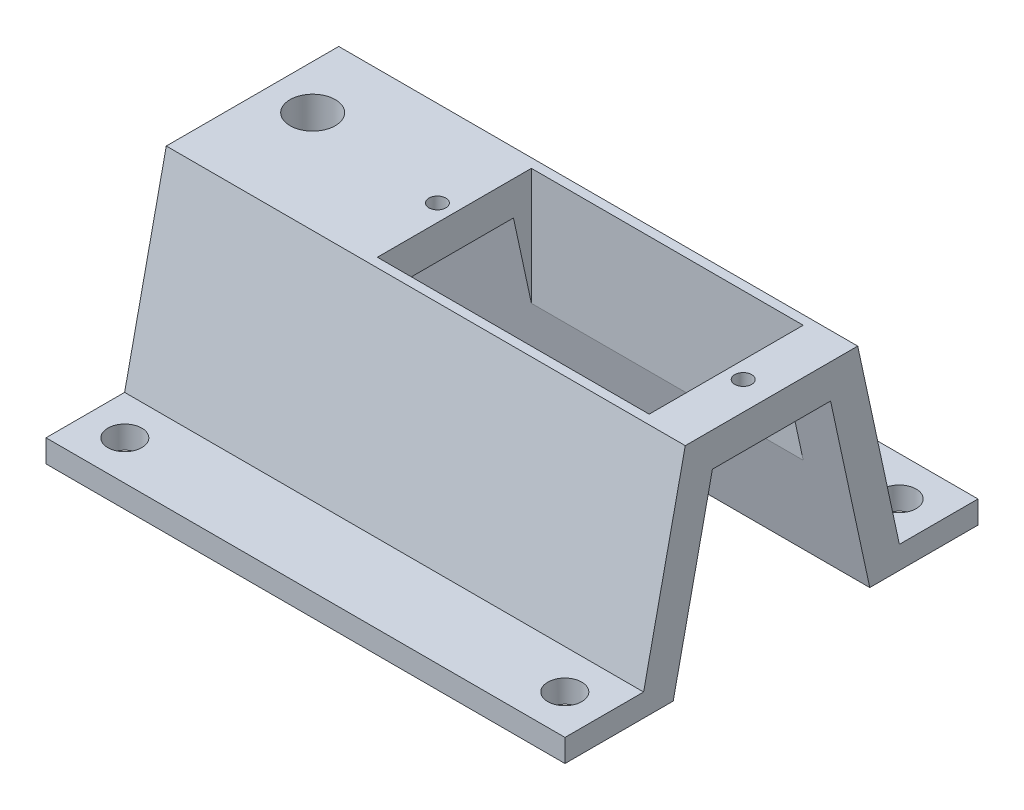
ISO-10303-21;
HEADER;
FILE_DESCRIPTION(('STEP AP214'),'2;1');
FILE_NAME('part.step','',(''),(''),'','','');
FILE_SCHEMA(('AUTOMOTIVE_DESIGN { 1 0 10303 214 1 1 1 1 }'));
ENDSEC;
DATA;
#1=APPLICATION_CONTEXT('core data for automotive mechanical design processes');
#2=APPLICATION_PROTOCOL_DEFINITION('international standard','automotive_design',2000,#1);
#3=PRODUCT_CONTEXT('',#1,'mechanical');
#4=PRODUCT('Part','Part','',(#3));
#5=PRODUCT_RELATED_PRODUCT_CATEGORY('part','',(#4));
#6=PRODUCT_DEFINITION_FORMATION('','',#4);
#7=PRODUCT_DEFINITION_CONTEXT('part definition',#1,'design');
#8=PRODUCT_DEFINITION('design','',#6,#7);
#9=PRODUCT_DEFINITION_SHAPE('','',#8);
#10=(LENGTH_UNIT() NAMED_UNIT(*) SI_UNIT(.MILLI.,.METRE.));
#11=(NAMED_UNIT(*) PLANE_ANGLE_UNIT() SI_UNIT($,.RADIAN.));
#12=(NAMED_UNIT(*) SI_UNIT($,.STERADIAN.) SOLID_ANGLE_UNIT());
#13=UNCERTAINTY_MEASURE_WITH_UNIT(LENGTH_MEASURE(1.E-05),#10,'distance_accuracy_value','');
#14=(GEOMETRIC_REPRESENTATION_CONTEXT(3) GLOBAL_UNCERTAINTY_ASSIGNED_CONTEXT((#13)) GLOBAL_UNIT_ASSIGNED_CONTEXT((#10,
#11,#12)) REPRESENTATION_CONTEXT('',''));
#15=CARTESIAN_POINT('',(0.,0.,0.));
#16=DIRECTION('',(0.,0.,1.));
#17=DIRECTION('',(1.,0.,0.));
#18=AXIS2_PLACEMENT_3D('',#15,#16,#17);
#19=CARTESIAN_POINT('',(16.,3.02819959593388,6.04711533635104));
#20=DIRECTION('',(0.,1.,0.));
#21=DIRECTION('',(0.,0.,1.));
#22=AXIS2_PLACEMENT_3D('',#19,#20,#21);
#23=PLANE('',#22);
#24=CARTESIAN_POINT('',(-25.9118097281455,3.02819959593388,-1.35212729891275));
#25=DIRECTION('',(0.,-1.,0.));
#26=DIRECTION('',(0.,0.,-1.));
#27=AXIS2_PLACEMENT_3D('',#24,#25,#26);
#28=CIRCLE('',#27,2.);
#29=CARTESIAN_POINT('',(-25.9118097281455,3.02819959593388,-3.35212729891275));
#30=VERTEX_POINT('',#29);
#31=EDGE_CURVE('E321',#30,#30,#28,.T.);
#32=ORIENTED_EDGE('',*,*,#31,.F.);
#33=EDGE_LOOP('',(#32));
#34=FACE_BOUND('',#33,.T.);
#35=CARTESIAN_POINT('',(-13.5,3.02819959593388,0.0471153363510377));
#36=DIRECTION('',(0.,1.,0.));
#37=DIRECTION('',(0.,0.,1.));
#38=AXIS2_PLACEMENT_3D('',#35,#36,#37);
#39=CIRCLE('',#38,0.75);
#40=CARTESIAN_POINT('',(-13.5,3.02819959593388,0.797115336351038));
#41=VERTEX_POINT('',#40);
#42=EDGE_CURVE('E240',#41,#41,#39,.T.);
#43=ORIENTED_EDGE('',*,*,#42,.T.);
#44=EDGE_LOOP('',(#43));
#45=FACE_BOUND('',#44,.T.);
#46=DIRECTION('',(0.,0.,-1.));
#47=VECTOR('',#46,1.);
#48=CARTESIAN_POINT('',(-12.,3.02819959593388,6.04711533635104));
#49=LINE('',#48,#47);
#50=CARTESIAN_POINT('',(-12.,3.02819959593388,5.26347606124684));
#51=VERTEX_POINT('',#50);
#52=CARTESIAN_POINT('',(-12.,3.02819959593389,-5.16924538854475));
#53=VERTEX_POINT('',#52);
#54=EDGE_CURVE('E344',#51,#53,#49,.T.);
#55=ORIENTED_EDGE('',*,*,#54,.F.);
#56=DIRECTION('',(-1.,0.,0.));
#57=VECTOR('',#56,1.);
#58=CARTESIAN_POINT('',(16.,3.02819959593388,5.26347606124684));
#59=LINE('',#58,#57);
#60=CARTESIAN_POINT('',(-29.8253336560652,3.02819959593388,5.26347606124684));
#61=VERTEX_POINT('',#60);
#62=EDGE_CURVE('E273',#51,#61,#59,.T.);
#63=ORIENTED_EDGE('',*,*,#62,.T.);
#64=DIRECTION('',(0.,0.,-1.));
#65=VECTOR('',#64,1.);
#66=CARTESIAN_POINT('',(-29.8253336560652,3.02819959593388,6.04711533635104));
#67=LINE('',#66,#65);
#68=CARTESIAN_POINT('',(-29.8253336560652,3.02819959593388,-5.16924538854476));
#69=VERTEX_POINT('',#68);
#70=EDGE_CURVE('E297',#61,#69,#67,.T.);
#71=ORIENTED_EDGE('',*,*,#70,.T.);
#72=DIRECTION('',(-1.,0.,0.));
#73=VECTOR('',#72,1.);
#74=CARTESIAN_POINT('',(16.,3.02819959593388,-5.16924538854476));
#75=LINE('',#74,#73);
#76=EDGE_CURVE('E277',#53,#69,#75,.T.);
#77=ORIENTED_EDGE('',*,*,#76,.F.);
#78=EDGE_LOOP('',(#55,#63,#71,#77));
#79=FACE_BOUND('',#78,.T.);
#80=ADVANCED_FACE('F83',(#34,#45,#79),#23,.F.);
#81=CARTESIAN_POINT('',(16.,-10.9717320567407,15.280676677086));
#82=DIRECTION('',(0.,1.,0.));
#83=DIRECTION('',(0.,0.,1.));
#84=AXIS2_PLACEMENT_3D('',#81,#82,#83);
#85=PLANE('',#84);
#86=CARTESIAN_POINT('',(12.5108355209188,-10.9717320567407,14.8096257080144));
#87=DIRECTION('',(0.,1.,0.));
#88=DIRECTION('',(0.,0.,-1.));
#89=AXIS2_PLACEMENT_3D('',#86,#87,#88);
#90=CIRCLE('',#89,1.5);
#91=CARTESIAN_POINT('',(12.5108355209188,-10.9717320567407,13.3096257080144));
#92=VERTEX_POINT('',#91);
#93=EDGE_CURVE('E439',#92,#92,#90,.T.);
#94=ORIENTED_EDGE('',*,*,#93,.F.);
#95=EDGE_LOOP('',(#94));
#96=FACE_BOUND('',#95,.T.);
#97=CARTESIAN_POINT('',(-26.3361691769839,-10.9717320567407,14.8096257080144));
#98=DIRECTION('',(0.,1.,0.));
#99=DIRECTION('',(0.,0.,1.));
#100=AXIS2_PLACEMENT_3D('',#97,#98,#99);
#101=CIRCLE('',#100,1.5);
#102=CARTESIAN_POINT('',(-26.3361691769839,-10.9717320567407,16.3096257080144));
#103=VERTEX_POINT('',#102);
#104=EDGE_CURVE('E436',#103,#103,#101,.T.);
#105=ORIENTED_EDGE('',*,*,#104,.F.);
#106=EDGE_LOOP('',(#105));
#107=FACE_BOUND('',#106,.T.);
#108=DIRECTION('',(0.,0.,-1.));
#109=VECTOR('',#108,1.);
#110=CARTESIAN_POINT('',(-29.8253336560652,-10.9717320567407,15.280676677086));
#111=LINE('',#110,#109);
#112=CARTESIAN_POINT('',(-29.8253336560652,-10.9717320567407,18.280676677086));
#113=VERTEX_POINT('',#112);
#114=CARTESIAN_POINT('',(-29.8253336560652,-10.9717320567407,11.3385747389429));
#115=VERTEX_POINT('',#114);
#116=EDGE_CURVE('E290',#113,#115,#111,.T.);
#117=ORIENTED_EDGE('',*,*,#116,.F.);
#118=DIRECTION('',(-1.,0.,0.));
#119=VECTOR('',#118,1.);
#120=CARTESIAN_POINT('',(16.,-10.9717320567407,18.280676677086));
#121=LINE('',#120,#119);
#122=CARTESIAN_POINT('',(16.,-10.9717320567407,18.280676677086));
#123=VERTEX_POINT('',#122);
#124=EDGE_CURVE('E12',#123,#113,#121,.T.);
#125=ORIENTED_EDGE('',*,*,#124,.F.);
#126=DIRECTION('',(0.,0.,-1.));
#127=VECTOR('',#126,1.);
#128=CARTESIAN_POINT('',(16.,-10.9717320567407,15.280676677086));
#129=LINE('',#128,#127);
#130=CARTESIAN_POINT('',(16.,-10.9717320567407,11.3385747389429));
#131=VERTEX_POINT('',#130);
#132=EDGE_CURVE('E228',#123,#131,#129,.T.);
#133=ORIENTED_EDGE('',*,*,#132,.T.);
#134=DIRECTION('',(-1.,0.,0.));
#135=VECTOR('',#134,1.);
#136=CARTESIAN_POINT('',(16.,-10.9717320567407,11.3385747389429));
#137=LINE('',#136,#135);
#138=EDGE_CURVE('E212',#131,#115,#137,.T.);
#139=ORIENTED_EDGE('',*,*,#138,.T.);
#140=EDGE_LOOP('',(#117,#125,#133,#139));
#141=FACE_BOUND('',#140,.T.);
#142=ADVANCED_FACE('F233',(#96,#107,#141),#85,.T.);
#143=CARTESIAN_POINT('',(16.,-10.9717320567407,18.280676677086));
#144=DIRECTION('',(0.,0.,-1.));
#145=DIRECTION('',(-1.,0.,0.));
#146=AXIS2_PLACEMENT_3D('',#143,#144,#145);
#147=PLANE('',#146);
#148=DIRECTION('',(0.,-1.,0.));
#149=VECTOR('',#148,1.);
#150=CARTESIAN_POINT('',(-29.8253336560652,-10.9717320567407,18.280676677086));
#151=LINE('',#150,#149);
#152=CARTESIAN_POINT('',(-29.8253336560652,-12.9717320567407,18.280676677086));
#153=VERTEX_POINT('',#152);
#154=EDGE_CURVE('E235',#113,#153,#151,.T.);
#155=ORIENTED_EDGE('',*,*,#154,.T.);
#156=DIRECTION('',(-1.,0.,0.));
#157=VECTOR('',#156,1.);
#158=CARTESIAN_POINT('',(16.,-12.9717320567407,18.280676677086));
#159=LINE('',#158,#157);
#160=CARTESIAN_POINT('',(16.,-12.9717320567407,18.280676677086));
#161=VERTEX_POINT('',#160);
#162=EDGE_CURVE('E93',#161,#153,#159,.T.);
#163=ORIENTED_EDGE('',*,*,#162,.F.);
#164=DIRECTION('',(0.,-1.,0.));
#165=VECTOR('',#164,1.);
#166=CARTESIAN_POINT('',(16.,-10.9717320567407,18.280676677086));
#167=LINE('',#166,#165);
#168=EDGE_CURVE('E223',#123,#161,#167,.T.);
#169=ORIENTED_EDGE('',*,*,#168,.F.);
#170=ORIENTED_EDGE('',*,*,#124,.T.);
#171=EDGE_LOOP('',(#155,#163,#169,#170));
#172=FACE_BOUND('',#171,.T.);
#173=ADVANCED_FACE('F403',(#172),#147,.F.);
#174=CARTESIAN_POINT('',(16.,-12.9717320567407,15.280676677086));
#175=DIRECTION('',(0.,1.,0.));
#176=DIRECTION('',(0.,0.,1.));
#177=AXIS2_PLACEMENT_3D('',#174,#175,#176);
#178=PLANE('',#177);
#179=CARTESIAN_POINT('',(12.5108355209188,-12.9717320567407,14.8096257080144));
#180=DIRECTION('',(0.,1.,0.));
#181=DIRECTION('',(0.,0.,1.));
#182=AXIS2_PLACEMENT_3D('',#179,#180,#181);
#183=CIRCLE('',#182,1.5);
#184=CARTESIAN_POINT('',(12.5108355209188,-12.9717320567407,16.3096257080144));
#185=VERTEX_POINT('',#184);
#186=EDGE_CURVE('E325',#185,#185,#183,.T.);
#187=ORIENTED_EDGE('',*,*,#186,.T.);
#188=EDGE_LOOP('',(#187));
#189=FACE_BOUND('',#188,.T.);
#190=CARTESIAN_POINT('',(-26.3361691769839,-12.9717320567407,14.8096257080144));
#191=DIRECTION('',(0.,1.,0.));
#192=DIRECTION('',(0.,0.,1.));
#193=AXIS2_PLACEMENT_3D('',#190,#191,#192);
#194=CIRCLE('',#193,1.5);
#195=CARTESIAN_POINT('',(-26.3361691769839,-12.9717320567407,16.3096257080144));
#196=VERTEX_POINT('',#195);
#197=EDGE_CURVE('E322',#196,#196,#194,.T.);
#198=ORIENTED_EDGE('',*,*,#197,.T.);
#199=EDGE_LOOP('',(#198));
#200=FACE_BOUND('',#199,.T.);
#201=DIRECTION('',(0.,0.,-1.));
#202=VECTOR('',#201,1.);
#203=CARTESIAN_POINT('',(-29.8253336560652,-12.9717320567407,15.280676677086));
#204=LINE('',#203,#202);
#205=CARTESIAN_POINT('',(-29.8253336560652,-12.9717320567407,8.72499628625341));
#206=VERTEX_POINT('',#205);
#207=EDGE_CURVE('E237',#153,#206,#204,.T.);
#208=ORIENTED_EDGE('',*,*,#207,.T.);
#209=DIRECTION('',(-1.,0.,0.));
#210=VECTOR('',#209,1.);
#211=CARTESIAN_POINT('',(16.,-12.9717320567407,8.72499628625341));
#212=LINE('',#211,#210);
#213=CARTESIAN_POINT('',(16.,-12.9717320567407,8.72499628625341));
#214=VERTEX_POINT('',#213);
#215=EDGE_CURVE('E266',#214,#206,#212,.T.);
#216=ORIENTED_EDGE('',*,*,#215,.F.);
#217=DIRECTION('',(0.,0.,-1.));
#218=VECTOR('',#217,1.);
#219=CARTESIAN_POINT('',(16.,-12.9717320567407,15.280676677086));
#220=LINE('',#219,#218);
#221=EDGE_CURVE('E253',#161,#214,#220,.T.);
#222=ORIENTED_EDGE('',*,*,#221,.F.);
#223=ORIENTED_EDGE('',*,*,#162,.T.);
#224=EDGE_LOOP('',(#208,#216,#222,#223));
#225=FACE_BOUND('',#224,.T.);
#226=ADVANCED_FACE('F417',(#189,#200,#225),#178,.F.);
#227=CARTESIAN_POINT('',(16.,4.02826794325932,5.04711533635103));
#228=DIRECTION('',(0.,-0.211453917058528,-0.977387968495932));
#229=DIRECTION('',(0.,0.977387968495932,-0.211453917058528));
#230=AXIS2_PLACEMENT_3D('',#227,#228,#229);
#231=PLANE('',#230);
#232=DIRECTION('',(0.,-0.977387968495932,0.211453917058528));
#233=VECTOR('',#232,1.);
#234=CARTESIAN_POINT('',(12.,4.02826794325932,5.04711533635103));
#235=LINE('',#234,#233);
#236=CARTESIAN_POINT('',(12.,3.02819959593388,5.26347606124684));
#237=VERTEX_POINT('',#236);
#238=CARTESIAN_POINT('',(12.,-4.29174034869266,6.84711533635104));
#239=VERTEX_POINT('',#238);
#240=EDGE_CURVE('E354',#237,#239,#235,.T.);
#241=ORIENTED_EDGE('',*,*,#240,.F.);
#242=CARTESIAN_POINT('',(16.,3.02819959593388,5.26347606124684));
#243=VERTEX_POINT('',#242);
#244=EDGE_CURVE('E268',#243,#237,#59,.T.);
#245=ORIENTED_EDGE('',*,*,#244,.F.);
#246=DIRECTION('',(0.,-0.977387968495932,0.211453917058528));
#247=VECTOR('',#246,1.);
#248=CARTESIAN_POINT('',(16.,4.02826794325932,5.04711533635103));
#249=LINE('',#248,#247);
#250=EDGE_CURVE('E255',#243,#214,#249,.T.);
#251=ORIENTED_EDGE('',*,*,#250,.T.);
#252=ORIENTED_EDGE('',*,*,#215,.T.);
#253=DIRECTION('',(0.,-0.977387968495932,0.211453917058528));
#254=VECTOR('',#253,1.);
#255=CARTESIAN_POINT('',(-29.8253336560652,4.02826794325932,5.04711533635103));
#256=LINE('',#255,#254);
#257=EDGE_CURVE('E294',#61,#206,#256,.T.);
#258=ORIENTED_EDGE('',*,*,#257,.F.);
#259=ORIENTED_EDGE('',*,*,#62,.F.);
#260=DIRECTION('',(0.,-0.977387968495932,0.211453917058528));
#261=VECTOR('',#260,1.);
#262=CARTESIAN_POINT('',(-12.,4.02826794325932,5.04711533635103));
#263=LINE('',#262,#261);
#264=CARTESIAN_POINT('',(-12.,-4.29174034869266,6.84711533635104));
#265=VERTEX_POINT('',#264);
#266=EDGE_CURVE('E333',#51,#265,#263,.T.);
#267=ORIENTED_EDGE('',*,*,#266,.T.);
#268=DIRECTION('',(1.,0.,0.));
#269=VECTOR('',#268,1.);
#270=CARTESIAN_POINT('',(16.,-4.29174034869266,6.84711533635104));
#271=LINE('',#270,#269);
#272=EDGE_CURVE('E329',#265,#239,#271,.T.);
#273=ORIENTED_EDGE('',*,*,#272,.T.);
#274=EDGE_LOOP('',(#241,#245,#251,#252,#258,#259,#267,#273));
#275=FACE_BOUND('',#274,.T.);
#276=ADVANCED_FACE('F384',(#275),#231,.T.);
#277=CARTESIAN_POINT('',(13.5,3.02819959593388,0.0471153363510377));
#278=DIRECTION('',(0.,1.,0.));
#279=DIRECTION('',(0.,0.,1.));
#280=AXIS2_PLACEMENT_3D('',#277,#278,#279);
#281=CIRCLE('',#280,0.75);
#282=CARTESIAN_POINT('',(13.5,3.02819959593388,0.797115336351038));
#283=VERTEX_POINT('',#282);
#284=EDGE_CURVE('E420',#283,#283,#281,.T.);
#285=ORIENTED_EDGE('',*,*,#284,.T.);
#286=EDGE_LOOP('',(#285));
#287=FACE_BOUND('',#286,.T.);
#288=ORIENTED_EDGE('',*,*,#244,.T.);
#289=DIRECTION('',(0.,0.,-1.));
#290=VECTOR('',#289,1.);
#291=CARTESIAN_POINT('',(12.,3.02819959593388,6.04711533635104));
#292=LINE('',#291,#290);
#293=CARTESIAN_POINT('',(12.,3.02819959593389,-5.16924538854475));
#294=VERTEX_POINT('',#293);
#295=EDGE_CURVE('E357',#237,#294,#292,.T.);
#296=ORIENTED_EDGE('',*,*,#295,.T.);
#297=CARTESIAN_POINT('',(16.,3.02819959593388,-5.16924538854476));
#298=VERTEX_POINT('',#297);
#299=EDGE_CURVE('E274',#298,#294,#75,.T.);
#300=ORIENTED_EDGE('',*,*,#299,.F.);
#301=DIRECTION('',(0.,0.,-1.));
#302=VECTOR('',#301,1.);
#303=CARTESIAN_POINT('',(16.,3.02819959593388,6.04711533635104));
#304=LINE('',#303,#302);
#305=EDGE_CURVE('E264',#243,#298,#304,.T.);
#306=ORIENTED_EDGE('',*,*,#305,.F.);
#307=EDGE_LOOP('',(#288,#296,#300,#306));
#308=FACE_BOUND('',#307,.T.);
#309=ADVANCED_FACE('F380',(#287,#308),#23,.F.);
#310=CARTESIAN_POINT('',(16.,-12.9717320567407,-8.63076561355134));
#311=DIRECTION('',(0.,-0.211453917058528,0.977387968495932));
#312=DIRECTION('',(0.,-0.977387968495932,-0.211453917058528));
#313=AXIS2_PLACEMENT_3D('',#310,#311,#312);
#314=PLANE('',#313);
#315=DIRECTION('',(0.,0.977387968495932,0.211453917058528));
#316=VECTOR('',#315,1.);
#317=CARTESIAN_POINT('',(12.,-12.9717320567407,-8.63076561355134));
#318=LINE('',#317,#316);
#319=CARTESIAN_POINT('',(12.,-4.29174034869266,-6.75288466364896));
#320=VERTEX_POINT('',#319);
#321=EDGE_CURVE('E332',#320,#294,#318,.T.);
#322=ORIENTED_EDGE('',*,*,#321,.F.);
#323=DIRECTION('',(1.,0.,0.));
#324=VECTOR('',#323,1.);
#325=CARTESIAN_POINT('',(16.,-4.29174034869266,-6.75288466364896));
#326=LINE('',#325,#324);
#327=CARTESIAN_POINT('',(-12.,-4.29174034869266,-6.75288466364896));
#328=VERTEX_POINT('',#327);
#329=EDGE_CURVE('E339',#328,#320,#326,.T.);
#330=ORIENTED_EDGE('',*,*,#329,.F.);
#331=DIRECTION('',(0.,0.977387968495932,0.211453917058528));
#332=VECTOR('',#331,1.);
#333=CARTESIAN_POINT('',(-12.,-12.9717320567407,-8.63076561355134));
#334=LINE('',#333,#332);
#335=EDGE_CURVE('E341',#328,#53,#334,.T.);
#336=ORIENTED_EDGE('',*,*,#335,.T.);
#337=ORIENTED_EDGE('',*,*,#76,.T.);
#338=DIRECTION('',(0.,0.977387968495932,0.211453917058528));
#339=VECTOR('',#338,1.);
#340=CARTESIAN_POINT('',(-29.8253336560652,-12.9717320567407,-8.63076561355134));
#341=LINE('',#340,#339);
#342=CARTESIAN_POINT('',(-29.8253336560652,-12.9717320567407,-8.63076561355134));
#343=VERTEX_POINT('',#342);
#344=EDGE_CURVE('E300',#343,#69,#341,.T.);
#345=ORIENTED_EDGE('',*,*,#344,.F.);
#346=DIRECTION('',(-1.,0.,0.));
#347=VECTOR('',#346,1.);
#348=CARTESIAN_POINT('',(16.,-12.9717320567407,-8.63076561355134));
#349=LINE('',#348,#347);
#350=CARTESIAN_POINT('',(16.,-12.9717320567407,-8.63076561355134));
#351=VERTEX_POINT('',#350);
#352=EDGE_CURVE('E280',#351,#343,#349,.T.);
#353=ORIENTED_EDGE('',*,*,#352,.F.);
#354=DIRECTION('',(0.,0.977387968495932,0.211453917058528));
#355=VECTOR('',#354,1.);
#356=CARTESIAN_POINT('',(16.,-12.9717320567407,-8.63076561355134));
#357=LINE('',#356,#355);
#358=EDGE_CURVE('E252',#351,#298,#357,.T.);
#359=ORIENTED_EDGE('',*,*,#358,.T.);
#360=ORIENTED_EDGE('',*,*,#299,.T.);
#361=EDGE_LOOP('',(#322,#330,#336,#337,#345,#353,#359,#360));
#362=FACE_BOUND('',#361,.T.);
#363=ADVANCED_FACE('F376',(#362),#314,.T.);
#364=CARTESIAN_POINT('',(16.,-12.9717320567407,-15.1864460043839));
#365=DIRECTION('',(0.,-1.,0.));
#366=DIRECTION('',(0.,0.,-1.));
#367=AXIS2_PLACEMENT_3D('',#364,#365,#366);
#368=PLANE('',#367);
#369=CARTESIAN_POINT('',(-26.3361691769839,-12.9717320567407,-14.7153950353124));
#370=DIRECTION('',(0.,-1.,0.));
#371=DIRECTION('',(0.,0.,-1.));
#372=AXIS2_PLACEMENT_3D('',#369,#370,#371);
#373=CIRCLE('',#372,1.5);
#374=CARTESIAN_POINT('',(-26.3361691769839,-12.9717320567407,-16.2153950353124));
#375=VERTEX_POINT('',#374);
#376=EDGE_CURVE('E326',#375,#375,#373,.T.);
#377=ORIENTED_EDGE('',*,*,#376,.F.);
#378=EDGE_LOOP('',(#377));
#379=FACE_BOUND('',#378,.T.);
#380=CARTESIAN_POINT('',(12.5108355209188,-12.9717320567407,-14.7153950353123));
#381=DIRECTION('',(0.,-1.,0.));
#382=DIRECTION('',(0.,0.,-1.));
#383=AXIS2_PLACEMENT_3D('',#380,#381,#382);
#384=CIRCLE('',#383,1.5);
#385=CARTESIAN_POINT('',(12.5108355209188,-12.9717320567407,-16.2153950353123));
#386=VERTEX_POINT('',#385);
#387=EDGE_CURVE('E433',#386,#386,#384,.T.);
#388=ORIENTED_EDGE('',*,*,#387,.F.);
#389=EDGE_LOOP('',(#388));
#390=FACE_BOUND('',#389,.T.);
#391=DIRECTION('',(0.,0.,1.));
#392=VECTOR('',#391,1.);
#393=CARTESIAN_POINT('',(-29.8253336560652,-12.9717320567407,-15.1864460043839));
#394=LINE('',#393,#392);
#395=CARTESIAN_POINT('',(-29.8253336560652,-12.9717320567407,-18.1864460043839));
#396=VERTEX_POINT('',#395);
#397=EDGE_CURVE('E303',#396,#343,#394,.T.);
#398=ORIENTED_EDGE('',*,*,#397,.F.);
#399=DIRECTION('',(-1.,0.,0.));
#400=VECTOR('',#399,1.);
#401=CARTESIAN_POINT('',(16.,-12.9717320567407,-18.1864460043839));
#402=LINE('',#401,#400);
#403=CARTESIAN_POINT('',(16.,-12.9717320567407,-18.1864460043839));
#404=VERTEX_POINT('',#403);
#405=EDGE_CURVE('E282',#404,#396,#402,.T.);
#406=ORIENTED_EDGE('',*,*,#405,.F.);
#407=DIRECTION('',(0.,0.,1.));
#408=VECTOR('',#407,1.);
#409=CARTESIAN_POINT('',(16.,-12.9717320567407,-15.1864460043839));
#410=LINE('',#409,#408);
#411=EDGE_CURVE('E249',#404,#351,#410,.T.);
#412=ORIENTED_EDGE('',*,*,#411,.T.);
#413=ORIENTED_EDGE('',*,*,#352,.T.);
#414=EDGE_LOOP('',(#398,#406,#412,#413));
#415=FACE_BOUND('',#414,.T.);
#416=ADVANCED_FACE('F415',(#379,#390,#415),#368,.T.);
#417=CARTESIAN_POINT('',(16.,-10.9717320567407,-18.1864460043839));
#418=DIRECTION('',(0.,0.,-1.));
#419=DIRECTION('',(-1.,0.,0.));
#420=AXIS2_PLACEMENT_3D('',#417,#418,#419);
#421=PLANE('',#420);
#422=DIRECTION('',(0.,-1.,0.));
#423=VECTOR('',#422,1.);
#424=CARTESIAN_POINT('',(-29.8253336560652,-10.9717320567407,-18.1864460043839));
#425=LINE('',#424,#423);
#426=CARTESIAN_POINT('',(-29.8253336560652,-10.9717320567407,-18.1864460043839));
#427=VERTEX_POINT('',#426);
#428=EDGE_CURVE('E306',#427,#396,#425,.T.);
#429=ORIENTED_EDGE('',*,*,#428,.F.);
#430=DIRECTION('',(-1.,0.,0.));
#431=VECTOR('',#430,1.);
#432=CARTESIAN_POINT('',(16.,-10.9717320567407,-18.1864460043839));
#433=LINE('',#432,#431);
#434=CARTESIAN_POINT('',(16.,-10.9717320567407,-18.1864460043839));
#435=VERTEX_POINT('',#434);
#436=EDGE_CURVE('E259',#435,#427,#433,.T.);
#437=ORIENTED_EDGE('',*,*,#436,.F.);
#438=DIRECTION('',(0.,-1.,0.));
#439=VECTOR('',#438,1.);
#440=CARTESIAN_POINT('',(16.,-10.9717320567407,-18.1864460043839));
#441=LINE('',#440,#439);
#442=EDGE_CURVE('E248',#435,#404,#441,.T.);
#443=ORIENTED_EDGE('',*,*,#442,.T.);
#444=ORIENTED_EDGE('',*,*,#405,.T.);
#445=EDGE_LOOP('',(#429,#437,#443,#444));
#446=FACE_BOUND('',#445,.T.);
#447=ADVANCED_FACE('F485',(#446),#421,.T.);
#448=CARTESIAN_POINT('',(16.,-10.9717320567407,-15.1864460043839));
#449=DIRECTION('',(0.,-1.,0.));
#450=DIRECTION('',(0.,0.,-1.));
#451=AXIS2_PLACEMENT_3D('',#448,#449,#450);
#452=PLANE('',#451);
#453=CARTESIAN_POINT('',(-26.3361691769839,-10.9717320567407,-14.7153950353124));
#454=DIRECTION('',(0.,1.,0.));
#455=DIRECTION('',(0.,0.,-1.));
#456=AXIS2_PLACEMENT_3D('',#453,#454,#455);
#457=CIRCLE('',#456,1.5);
#458=CARTESIAN_POINT('',(-26.3361691769839,-10.9717320567407,-16.2153950353124));
#459=VERTEX_POINT('',#458);
#460=EDGE_CURVE('E440',#459,#459,#457,.T.);
#461=ORIENTED_EDGE('',*,*,#460,.F.);
#462=EDGE_LOOP('',(#461));
#463=FACE_BOUND('',#462,.T.);
#464=CARTESIAN_POINT('',(12.5108355209188,-10.9717320567407,-14.7153950353123));
#465=DIRECTION('',(0.,1.,0.));
#466=DIRECTION('',(0.,0.,1.));
#467=AXIS2_PLACEMENT_3D('',#464,#465,#466);
#468=CIRCLE('',#467,1.5);
#469=CARTESIAN_POINT('',(12.5108355209188,-10.9717320567407,-13.2153950353123));
#470=VERTEX_POINT('',#469);
#471=EDGE_CURVE('E443',#470,#470,#468,.T.);
#472=ORIENTED_EDGE('',*,*,#471,.F.);
#473=EDGE_LOOP('',(#472));
#474=FACE_BOUND('',#473,.T.);
#475=DIRECTION('',(0.,0.,1.));
#476=VECTOR('',#475,1.);
#477=CARTESIAN_POINT('',(-29.8253336560652,-10.9717320567407,-15.1864460043839));
#478=LINE('',#477,#476);
#479=CARTESIAN_POINT('',(-29.8253336560652,-10.9717320567407,-11.2443440662408));
#480=VERTEX_POINT('',#479);
#481=EDGE_CURVE('E309',#427,#480,#478,.T.);
#482=ORIENTED_EDGE('',*,*,#481,.T.);
#483=DIRECTION('',(-1.,0.,0.));
#484=VECTOR('',#483,1.);
#485=CARTESIAN_POINT('',(16.,-10.9717320567407,-11.2443440662408));
#486=LINE('',#485,#484);
#487=CARTESIAN_POINT('',(16.,-10.9717320567407,-11.2443440662408));
#488=VERTEX_POINT('',#487);
#489=EDGE_CURVE('E256',#488,#480,#486,.T.);
#490=ORIENTED_EDGE('',*,*,#489,.F.);
#491=DIRECTION('',(0.,0.,1.));
#492=VECTOR('',#491,1.);
#493=CARTESIAN_POINT('',(16.,-10.9717320567407,-15.1864460043839));
#494=LINE('',#493,#492);
#495=EDGE_CURVE('E246',#435,#488,#494,.T.);
#496=ORIENTED_EDGE('',*,*,#495,.F.);
#497=ORIENTED_EDGE('',*,*,#436,.T.);
#498=EDGE_LOOP('',(#482,#490,#496,#497));
#499=FACE_BOUND('',#498,.T.);
#500=ADVANCED_FACE('F489',(#463,#474,#499),#452,.F.);
#501=CARTESIAN_POINT('',(16.,-10.9717320567407,-11.2443440662408));
#502=DIRECTION('',(0.,-0.211453917058528,0.977387968495932));
#503=DIRECTION('',(0.,-0.977387968495932,-0.211453917058528));
#504=AXIS2_PLACEMENT_3D('',#501,#502,#503);
#505=PLANE('',#504);
#506=DIRECTION('',(0.,0.977387968495932,0.211453917058528));
#507=VECTOR('',#506,1.);
#508=CARTESIAN_POINT('',(-29.8253336560652,-10.9717320567407,-11.2443440662408));
#509=LINE('',#508,#507);
#510=CARTESIAN_POINT('',(-29.8253336560652,6.02826794325932,-7.56646311633841));
#511=VERTEX_POINT('',#510);
#512=EDGE_CURVE('E311',#480,#511,#509,.T.);
#513=ORIENTED_EDGE('',*,*,#512,.T.);
#514=DIRECTION('',(-1.,0.,0.));
#515=VECTOR('',#514,1.);
#516=CARTESIAN_POINT('',(16.,6.02826794325932,-7.56646311633841));
#517=LINE('',#516,#515);
#518=CARTESIAN_POINT('',(16.,6.02826794325932,-7.56646311633841));
#519=VERTEX_POINT('',#518);
#520=EDGE_CURVE('E260',#519,#511,#517,.T.);
#521=ORIENTED_EDGE('',*,*,#520,.F.);
#522=DIRECTION('',(0.,0.977387968495932,0.211453917058528));
#523=VECTOR('',#522,1.);
#524=CARTESIAN_POINT('',(16.,-10.9717320567407,-11.2443440662408));
#525=LINE('',#524,#523);
#526=EDGE_CURVE('E244',#488,#519,#525,.T.);
#527=ORIENTED_EDGE('',*,*,#526,.F.);
#528=ORIENTED_EDGE('',*,*,#489,.T.);
#529=EDGE_LOOP('',(#513,#521,#527,#528));
#530=FACE_BOUND('',#529,.T.);
#531=ADVANCED_FACE('F493',(#530),#505,.F.);
#532=CARTESIAN_POINT('',(16.,6.02826794325932,-7.56646311633841));
#533=DIRECTION('',(0.,-1.,0.));
#534=DIRECTION('',(0.,0.,-1.));
#535=AXIS2_PLACEMENT_3D('',#532,#533,#534);
#536=PLANE('',#535);
#537=CARTESIAN_POINT('',(-25.9118097281455,6.02826794325932,-1.35212729891275));
#538=DIRECTION('',(0.,-1.,0.));
#539=DIRECTION('',(0.,0.,-1.));
#540=AXIS2_PLACEMENT_3D('',#537,#538,#539);
#541=CIRCLE('',#540,2.);
#542=CARTESIAN_POINT('',(-25.9118097281455,6.02826794325932,-3.35212729891275));
#543=VERTEX_POINT('',#542);
#544=EDGE_CURVE('E317',#543,#543,#541,.T.);
#545=ORIENTED_EDGE('',*,*,#544,.T.);
#546=EDGE_LOOP('',(#545));
#547=FACE_BOUND('',#546,.T.);
#548=DIRECTION('',(-1.,0.,0.));
#549=VECTOR('',#548,1.);
#550=CARTESIAN_POINT('',(11.,6.02826794325932,-6.75288466364896));
#551=LINE('',#550,#549);
#552=CARTESIAN_POINT('',(12.,6.02826794325932,-6.75288466364896));
#553=VERTEX_POINT('',#552);
#554=CARTESIAN_POINT('',(-12.,6.02826794325932,-6.75288466364896));
#555=VERTEX_POINT('',#554);
#556=EDGE_CURVE('E342',#553,#555,#551,.T.);
#557=ORIENTED_EDGE('',*,*,#556,.F.);
#558=DIRECTION('',(0.,0.,-1.));
#559=VECTOR('',#558,1.);
#560=CARTESIAN_POINT('',(12.,6.02826794325932,6.04711533635104));
#561=LINE('',#560,#559);
#562=CARTESIAN_POINT('',(12.,6.02826794325932,6.84711533635104));
#563=VERTEX_POINT('',#562);
#564=EDGE_CURVE('E320',#563,#553,#561,.T.);
#565=ORIENTED_EDGE('',*,*,#564,.F.);
#566=DIRECTION('',(-1.,0.,0.));
#567=VECTOR('',#566,1.);
#568=CARTESIAN_POINT('',(11.,6.02826794325932,6.84711533635104));
#569=LINE('',#568,#567);
#570=CARTESIAN_POINT('',(-12.,6.02826794325932,6.84711533635104));
#571=VERTEX_POINT('',#570);
#572=EDGE_CURVE('E334',#563,#571,#569,.T.);
#573=ORIENTED_EDGE('',*,*,#572,.T.);
#574=DIRECTION('',(0.,0.,-1.));
#575=VECTOR('',#574,1.);
#576=CARTESIAN_POINT('',(-12.,6.02826794325932,6.04711533635104));
#577=LINE('',#576,#575);
#578=EDGE_CURVE('E338',#571,#555,#577,.T.);
#579=ORIENTED_EDGE('',*,*,#578,.T.);
#580=EDGE_LOOP('',(#557,#565,#573,#579));
#581=FACE_BOUND('',#580,.T.);
#582=CARTESIAN_POINT('',(-13.5,6.02826794325932,0.0471153363510377));
#583=DIRECTION('',(0.,1.,0.));
#584=DIRECTION('',(0.,0.,-1.));
#585=AXIS2_PLACEMENT_3D('',#582,#583,#584);
#586=CIRCLE('',#585,0.75);
#587=CARTESIAN_POINT('',(-13.5,6.02826794325932,-0.702884663648963));
#588=VERTEX_POINT('',#587);
#589=EDGE_CURVE('E422',#588,#588,#586,.T.);
#590=ORIENTED_EDGE('',*,*,#589,.F.);
#591=EDGE_LOOP('',(#590));
#592=FACE_BOUND('',#591,.T.);
#593=CARTESIAN_POINT('',(13.5,6.02826794325932,0.0471153363510377));
#594=DIRECTION('',(0.,1.,0.));
#595=DIRECTION('',(0.,0.,1.));
#596=AXIS2_PLACEMENT_3D('',#593,#594,#595);
#597=CIRCLE('',#596,0.75);
#598=CARTESIAN_POINT('',(13.5,6.02826794325932,0.797115336351038));
#599=VERTEX_POINT('',#598);
#600=EDGE_CURVE('E356',#599,#599,#597,.T.);
#601=ORIENTED_EDGE('',*,*,#600,.F.);
#602=EDGE_LOOP('',(#601));
#603=FACE_BOUND('',#602,.T.);
#604=DIRECTION('',(0.,0.,1.));
#605=VECTOR('',#604,1.);
#606=CARTESIAN_POINT('',(-29.8253336560652,6.02826794325932,-7.56646311633841));
#607=LINE('',#606,#605);
#608=CARTESIAN_POINT('',(-29.8253336560652,6.02826794325932,7.66069378904048));
#609=VERTEX_POINT('',#608);
#610=EDGE_CURVE('E313',#511,#609,#607,.T.);
#611=ORIENTED_EDGE('',*,*,#610,.T.);
#612=DIRECTION('',(-1.,0.,0.));
#613=VECTOR('',#612,1.);
#614=CARTESIAN_POINT('',(16.,6.02826794325932,7.66069378904048));
#615=LINE('',#614,#613);
#616=CARTESIAN_POINT('',(16.,6.02826794325932,7.66069378904048));
#617=VERTEX_POINT('',#616);
#618=EDGE_CURVE('E222',#617,#609,#615,.T.);
#619=ORIENTED_EDGE('',*,*,#618,.F.);
#620=DIRECTION('',(0.,0.,1.));
#621=VECTOR('',#620,1.);
#622=CARTESIAN_POINT('',(16.,6.02826794325932,-7.56646311633841));
#623=LINE('',#622,#621);
#624=EDGE_CURVE('E230',#519,#617,#623,.T.);
#625=ORIENTED_EDGE('',*,*,#624,.F.);
#626=ORIENTED_EDGE('',*,*,#520,.T.);
#627=EDGE_LOOP('',(#611,#619,#625,#626));
#628=FACE_BOUND('',#627,.T.);
#629=ADVANCED_FACE('F369',(#547,#581,#592,#603,#628),#536,.F.);
#630=CARTESIAN_POINT('',(16.,-10.9717320567407,11.3385747389429));
#631=DIRECTION('',(0.,0.211453917058528,0.977387968495932));
#632=DIRECTION('',(0.,-0.977387968495932,0.211453917058528));
#633=AXIS2_PLACEMENT_3D('',#630,#631,#632);
#634=PLANE('',#633);
#635=DIRECTION('',(0.,0.977387968495932,-0.211453917058528));
#636=VECTOR('',#635,1.);
#637=CARTESIAN_POINT('',(-29.8253336560652,-10.9717320567407,11.3385747389429));
#638=LINE('',#637,#636);
#639=EDGE_CURVE('E217',#115,#609,#638,.T.);
#640=ORIENTED_EDGE('',*,*,#639,.F.);
#641=ORIENTED_EDGE('',*,*,#138,.F.);
#642=DIRECTION('',(0.,0.977387968495932,-0.211453917058528));
#643=VECTOR('',#642,1.);
#644=CARTESIAN_POINT('',(16.,-10.9717320567407,11.3385747389429));
#645=LINE('',#644,#643);
#646=EDGE_CURVE('E215',#131,#617,#645,.T.);
#647=ORIENTED_EDGE('',*,*,#646,.T.);
#648=ORIENTED_EDGE('',*,*,#618,.T.);
#649=EDGE_LOOP('',(#640,#641,#647,#648));
#650=FACE_BOUND('',#649,.T.);
#651=ADVANCED_FACE('F214',(#650),#634,.T.);
#652=CARTESIAN_POINT('',(16.,0.,-40.27612723124));
#653=DIRECTION('',(-1.,0.,0.));
#654=DIRECTION('',(0.,0.,1.));
#655=AXIS2_PLACEMENT_3D('',#652,#653,#654);
#656=PLANE('',#655);
#657=ORIENTED_EDGE('',*,*,#132,.F.);
#658=ORIENTED_EDGE('',*,*,#168,.T.);
#659=ORIENTED_EDGE('',*,*,#221,.T.);
#660=ORIENTED_EDGE('',*,*,#250,.F.);
#661=ORIENTED_EDGE('',*,*,#305,.T.);
#662=ORIENTED_EDGE('',*,*,#358,.F.);
#663=ORIENTED_EDGE('',*,*,#411,.F.);
#664=ORIENTED_EDGE('',*,*,#442,.F.);
#665=ORIENTED_EDGE('',*,*,#495,.T.);
#666=ORIENTED_EDGE('',*,*,#526,.T.);
#667=ORIENTED_EDGE('',*,*,#624,.T.);
#668=ORIENTED_EDGE('',*,*,#646,.F.);
#669=EDGE_LOOP('',(#657,#658,#659,#660,#661,#662,#663,#664,#665,#666,#667,#668));
#670=FACE_BOUND('',#669,.T.);
#671=ADVANCED_FACE('F227',(#670),#656,.F.);
#672=CARTESIAN_POINT('',(-29.8253336560652,0.,-40.27612723124));
#673=DIRECTION('',(-1.,0.,0.));
#674=DIRECTION('',(0.,0.,1.));
#675=AXIS2_PLACEMENT_3D('',#672,#673,#674);
#676=PLANE('',#675);
#677=ORIENTED_EDGE('',*,*,#116,.T.);
#678=ORIENTED_EDGE('',*,*,#639,.T.);
#679=ORIENTED_EDGE('',*,*,#610,.F.);
#680=ORIENTED_EDGE('',*,*,#512,.F.);
#681=ORIENTED_EDGE('',*,*,#481,.F.);
#682=ORIENTED_EDGE('',*,*,#428,.T.);
#683=ORIENTED_EDGE('',*,*,#397,.T.);
#684=ORIENTED_EDGE('',*,*,#344,.T.);
#685=ORIENTED_EDGE('',*,*,#70,.F.);
#686=ORIENTED_EDGE('',*,*,#257,.T.);
#687=ORIENTED_EDGE('',*,*,#207,.F.);
#688=ORIENTED_EDGE('',*,*,#154,.F.);
#689=EDGE_LOOP('',(#677,#678,#679,#680,#681,#682,#683,#684,#685,#686,#687,#688));
#690=FACE_BOUND('',#689,.T.);
#691=ADVANCED_FACE('F473',(#690),#676,.T.);
#692=CARTESIAN_POINT('',(13.5,-25.9717320567407,0.0471153363510377));
#693=DIRECTION('',(0.,1.,0.));
#694=DIRECTION('',(0.,0.,1.));
#695=AXIS2_PLACEMENT_3D('',#692,#693,#694);
#696=CYLINDRICAL_SURFACE('',#695,0.75);
#697=ORIENTED_EDGE('',*,*,#600,.T.);
#698=EDGE_LOOP('',(#697));
#699=FACE_BOUND('',#698,.T.);
#700=ORIENTED_EDGE('',*,*,#284,.F.);
#701=EDGE_LOOP('',(#700));
#702=FACE_BOUND('',#701,.T.);
#703=ADVANCED_FACE('F506',(#699,#702),#696,.F.);
#704=CARTESIAN_POINT('',(-13.5,-25.9717320567407,0.0471153363510377));
#705=DIRECTION('',(0.,1.,0.));
#706=DIRECTION('',(0.,0.,1.));
#707=AXIS2_PLACEMENT_3D('',#704,#705,#706);
#708=CYLINDRICAL_SURFACE('',#707,0.75);
#709=ORIENTED_EDGE('',*,*,#589,.T.);
#710=EDGE_LOOP('',(#709));
#711=FACE_BOUND('',#710,.T.);
#712=ORIENTED_EDGE('',*,*,#42,.F.);
#713=EDGE_LOOP('',(#712));
#714=FACE_BOUND('',#713,.T.);
#715=ADVANCED_FACE('F393',(#711,#714),#708,.F.);
#716=CARTESIAN_POINT('',(12.,-3.97173205674068,6.04711533635104));
#717=DIRECTION('',(1.,0.,0.));
#718=DIRECTION('',(0.,0.,-1.));
#719=AXIS2_PLACEMENT_3D('',#716,#717,#718);
#720=PLANE('',#719);
#721=ORIENTED_EDGE('',*,*,#240,.T.);
#722=DIRECTION('',(0.,1.,0.));
#723=VECTOR('',#722,1.);
#724=CARTESIAN_POINT('',(12.,-3.97173205674068,6.84711533635104));
#725=LINE('',#724,#723);
#726=EDGE_CURVE('E87',#239,#563,#725,.T.);
#727=ORIENTED_EDGE('',*,*,#726,.T.);
#728=ORIENTED_EDGE('',*,*,#564,.T.);
#729=DIRECTION('',(0.,1.,0.));
#730=VECTOR('',#729,1.);
#731=CARTESIAN_POINT('',(12.,-3.97173205674068,-6.75288466364896));
#732=LINE('',#731,#730);
#733=EDGE_CURVE('E337',#320,#553,#732,.T.);
#734=ORIENTED_EDGE('',*,*,#733,.F.);
#735=ORIENTED_EDGE('',*,*,#321,.T.);
#736=ORIENTED_EDGE('',*,*,#295,.F.);
#737=EDGE_LOOP('',(#721,#727,#728,#734,#735,#736));
#738=FACE_BOUND('',#737,.T.);
#739=ADVANCED_FACE('F85',(#738),#720,.F.);
#740=CARTESIAN_POINT('',(11.,-3.97173205674068,6.84711533635104));
#741=DIRECTION('',(0.,0.,-1.));
#742=DIRECTION('',(-1.,0.,0.));
#743=AXIS2_PLACEMENT_3D('',#740,#741,#742);
#744=PLANE('',#743);
#745=DIRECTION('',(0.,1.,0.));
#746=VECTOR('',#745,1.);
#747=CARTESIAN_POINT('',(-12.,-3.97173205674068,6.84711533635104));
#748=LINE('',#747,#746);
#749=EDGE_CURVE('E135',#265,#571,#748,.T.);
#750=ORIENTED_EDGE('',*,*,#749,.T.);
#751=ORIENTED_EDGE('',*,*,#572,.F.);
#752=ORIENTED_EDGE('',*,*,#726,.F.);
#753=ORIENTED_EDGE('',*,*,#272,.F.);
#754=EDGE_LOOP('',(#750,#751,#752,#753));
#755=FACE_BOUND('',#754,.T.);
#756=ADVANCED_FACE('F385',(#755),#744,.T.);
#757=CARTESIAN_POINT('',(-12.,-3.97173205674068,6.04711533635104));
#758=DIRECTION('',(1.,0.,0.));
#759=DIRECTION('',(0.,0.,-1.));
#760=AXIS2_PLACEMENT_3D('',#757,#758,#759);
#761=PLANE('',#760);
#762=ORIENTED_EDGE('',*,*,#54,.T.);
#763=ORIENTED_EDGE('',*,*,#335,.F.);
#764=DIRECTION('',(0.,1.,0.));
#765=VECTOR('',#764,1.);
#766=CARTESIAN_POINT('',(-12.,-3.97173205674068,-6.75288466364896));
#767=LINE('',#766,#765);
#768=EDGE_CURVE('E102',#328,#555,#767,.T.);
#769=ORIENTED_EDGE('',*,*,#768,.T.);
#770=ORIENTED_EDGE('',*,*,#578,.F.);
#771=ORIENTED_EDGE('',*,*,#749,.F.);
#772=ORIENTED_EDGE('',*,*,#266,.F.);
#773=EDGE_LOOP('',(#762,#763,#769,#770,#771,#772));
#774=FACE_BOUND('',#773,.T.);
#775=ADVANCED_FACE('F372',(#774),#761,.T.);
#776=CARTESIAN_POINT('',(11.,-3.97173205674068,-6.75288466364896));
#777=DIRECTION('',(0.,0.,-1.));
#778=DIRECTION('',(-1.,0.,0.));
#779=AXIS2_PLACEMENT_3D('',#776,#777,#778);
#780=PLANE('',#779);
#781=ORIENTED_EDGE('',*,*,#329,.T.);
#782=ORIENTED_EDGE('',*,*,#733,.T.);
#783=ORIENTED_EDGE('',*,*,#556,.T.);
#784=ORIENTED_EDGE('',*,*,#768,.F.);
#785=EDGE_LOOP('',(#781,#782,#783,#784));
#786=FACE_BOUND('',#785,.T.);
#787=ADVANCED_FACE('F367',(#786),#780,.F.);
#788=CARTESIAN_POINT('',(-25.9118097281455,13.0281995959339,-1.35212729891275));
#789=DIRECTION('',(0.,-1.,0.));
#790=DIRECTION('',(0.,0.,-1.));
#791=AXIS2_PLACEMENT_3D('',#788,#789,#790);
#792=CYLINDRICAL_SURFACE('',#791,2.);
#793=ORIENTED_EDGE('',*,*,#31,.T.);
#794=EDGE_LOOP('',(#793));
#795=FACE_BOUND('',#794,.T.);
#796=ORIENTED_EDGE('',*,*,#544,.F.);
#797=EDGE_LOOP('',(#796));
#798=FACE_BOUND('',#797,.T.);
#799=ADVANCED_FACE('F535',(#795,#798),#792,.F.);
#800=CARTESIAN_POINT('',(12.5108355209188,-20.9717320567407,-14.7153950353123));
#801=DIRECTION('',(0.,1.,0.));
#802=DIRECTION('',(0.,0.,1.));
#803=AXIS2_PLACEMENT_3D('',#800,#801,#802);
#804=CYLINDRICAL_SURFACE('',#803,1.5);
#805=ORIENTED_EDGE('',*,*,#387,.T.);
#806=EDGE_LOOP('',(#805));
#807=FACE_BOUND('',#806,.T.);
#808=ORIENTED_EDGE('',*,*,#471,.T.);
#809=EDGE_LOOP('',(#808));
#810=FACE_BOUND('',#809,.T.);
#811=ADVANCED_FACE('F536',(#807,#810),#804,.F.);
#812=CARTESIAN_POINT('',(-26.3361691769839,-20.9717320567407,-14.7153950353124));
#813=DIRECTION('',(0.,1.,0.));
#814=DIRECTION('',(0.,0.,1.));
#815=AXIS2_PLACEMENT_3D('',#812,#813,#814);
#816=CYLINDRICAL_SURFACE('',#815,1.5);
#817=ORIENTED_EDGE('',*,*,#376,.T.);
#818=EDGE_LOOP('',(#817));
#819=FACE_BOUND('',#818,.T.);
#820=ORIENTED_EDGE('',*,*,#460,.T.);
#821=EDGE_LOOP('',(#820));
#822=FACE_BOUND('',#821,.T.);
#823=ADVANCED_FACE('F457',(#819,#822),#816,.F.);
#824=CARTESIAN_POINT('',(-26.3361691769839,-20.9717320567407,14.8096257080144));
#825=DIRECTION('',(0.,1.,0.));
#826=DIRECTION('',(0.,0.,1.));
#827=AXIS2_PLACEMENT_3D('',#824,#825,#826);
#828=CYLINDRICAL_SURFACE('',#827,1.5);
#829=ORIENTED_EDGE('',*,*,#104,.T.);
#830=EDGE_LOOP('',(#829));
#831=FACE_BOUND('',#830,.T.);
#832=ORIENTED_EDGE('',*,*,#197,.F.);
#833=EDGE_LOOP('',(#832));
#834=FACE_BOUND('',#833,.T.);
#835=ADVANCED_FACE('F454',(#831,#834),#828,.F.);
#836=CARTESIAN_POINT('',(12.5108355209188,-20.9717320567407,14.8096257080144));
#837=DIRECTION('',(0.,1.,0.));
#838=DIRECTION('',(0.,0.,1.));
#839=AXIS2_PLACEMENT_3D('',#836,#837,#838);
#840=CYLINDRICAL_SURFACE('',#839,1.5);
#841=ORIENTED_EDGE('',*,*,#93,.T.);
#842=EDGE_LOOP('',(#841));
#843=FACE_BOUND('',#842,.T.);
#844=ORIENTED_EDGE('',*,*,#186,.F.);
#845=EDGE_LOOP('',(#844));
#846=FACE_BOUND('',#845,.T.);
#847=ADVANCED_FACE('F449',(#843,#846),#840,.F.);
#848=CLOSED_SHELL('',(#80,#142,#173,#226,#276,#309,#363,#416,#447,#500,#531,#629,#651,#671,#691,
#703,#715,#739,#756,#775,#787,#799,#811,#823,#835,#847));
#849=MANIFOLD_SOLID_BREP('B2',#848);
#850=ADVANCED_BREP_SHAPE_REPRESENTATION('',(#18,#849),#14);
#851=SHAPE_DEFINITION_REPRESENTATION(#9,#850);
ENDSEC;
END-ISO-10303-21;
